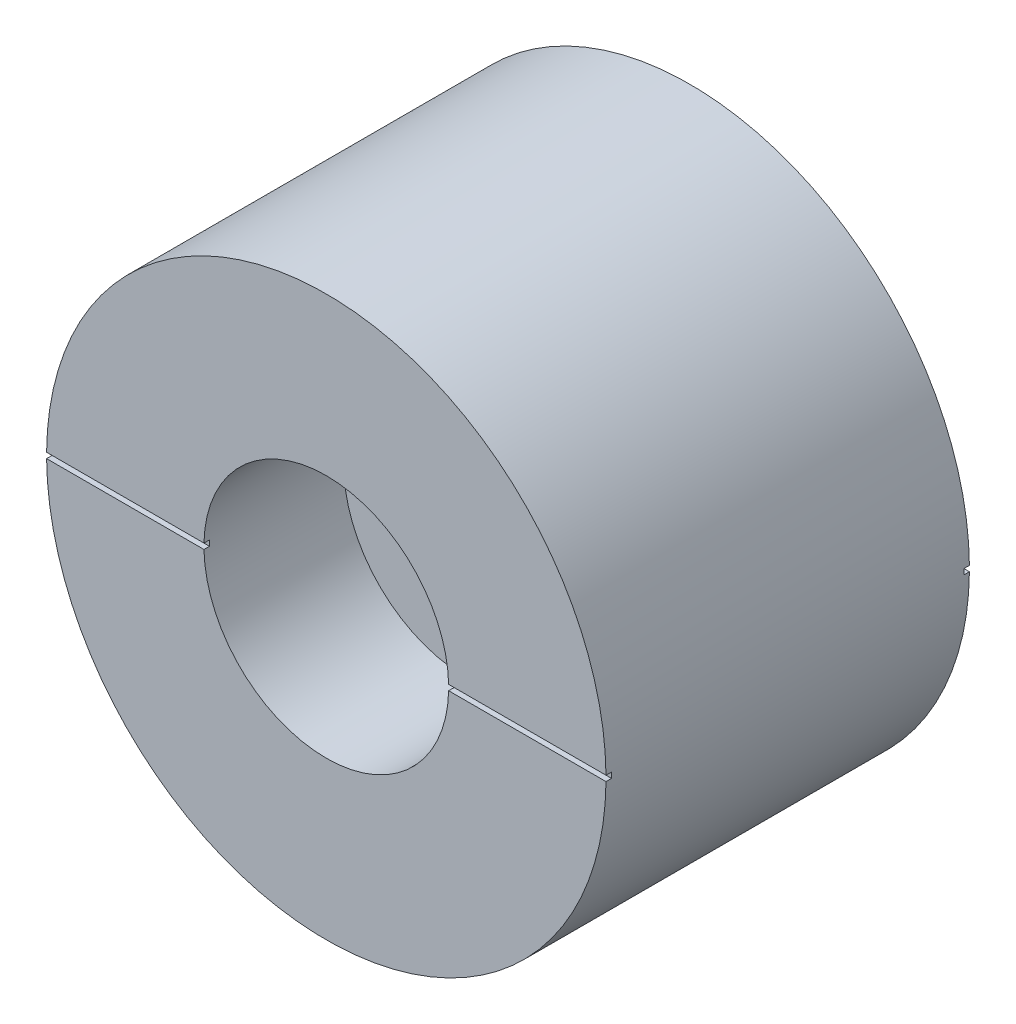
ISO-10303-21;
HEADER;
FILE_DESCRIPTION(('STEP AP214'),'2;1');
FILE_NAME('part.step','',(''),(''),'','','');
FILE_SCHEMA(('AUTOMOTIVE_DESIGN { 1 0 10303 214 1 1 1 1 }'));
ENDSEC;
DATA;
#1=APPLICATION_CONTEXT('core data for automotive mechanical design processes');
#2=APPLICATION_PROTOCOL_DEFINITION('international standard','automotive_design',2000,#1);
#3=PRODUCT_CONTEXT('',#1,'mechanical');
#4=PRODUCT('Part','Part','',(#3));
#5=PRODUCT_RELATED_PRODUCT_CATEGORY('part','',(#4));
#6=PRODUCT_DEFINITION_FORMATION('','',#4);
#7=PRODUCT_DEFINITION_CONTEXT('part definition',#1,'design');
#8=PRODUCT_DEFINITION('design','',#6,#7);
#9=PRODUCT_DEFINITION_SHAPE('','',#8);
#10=(LENGTH_UNIT() NAMED_UNIT(*) SI_UNIT(.MILLI.,.METRE.));
#11=(NAMED_UNIT(*) PLANE_ANGLE_UNIT() SI_UNIT($,.RADIAN.));
#12=(NAMED_UNIT(*) SI_UNIT($,.STERADIAN.) SOLID_ANGLE_UNIT());
#13=UNCERTAINTY_MEASURE_WITH_UNIT(LENGTH_MEASURE(1.E-05),#10,'distance_accuracy_value','');
#14=(GEOMETRIC_REPRESENTATION_CONTEXT(3) GLOBAL_UNCERTAINTY_ASSIGNED_CONTEXT((#13)) GLOBAL_UNIT_ASSIGNED_CONTEXT((#10,
#11,#12)) REPRESENTATION_CONTEXT('',''));
#15=CARTESIAN_POINT('',(0.,0.,0.));
#16=DIRECTION('',(0.,0.,1.));
#17=DIRECTION('',(1.,0.,0.));
#18=AXIS2_PLACEMENT_3D('',#15,#16,#17);
#19=CARTESIAN_POINT('',(0.,0.,0.));
#20=DIRECTION('',(0.,0.,1.));
#21=DIRECTION('',(1.,0.,0.));
#22=AXIS2_PLACEMENT_3D('',#19,#20,#21);
#23=PLANE('',#22);
#24=CARTESIAN_POINT('',(0.,0.,0.));
#25=DIRECTION('',(0.,0.,1.));
#26=DIRECTION('',(1.,0.,0.));
#27=AXIS2_PLACEMENT_3D('',#24,#25,#26);
#28=CIRCLE('',#27,12.7);
#29=CARTESIAN_POINT('',(12.6993848276206,0.125,0.));
#30=VERTEX_POINT('',#29);
#31=CARTESIAN_POINT('',(-12.6993848276206,0.125,0.));
#32=VERTEX_POINT('',#31);
#33=EDGE_CURVE('E525',#30,#32,#28,.T.);
#34=ORIENTED_EDGE('',*,*,#33,.F.);
#35=DIRECTION('',(1.,0.,0.));
#36=VECTOR('',#35,1.);
#37=CARTESIAN_POINT('',(13.4907838938573,0.125,0.));
#38=LINE('',#37,#36);
#39=CARTESIAN_POINT('',(3.2615055127962,0.125,0.));
#40=VERTEX_POINT('',#39);
#41=EDGE_CURVE('E519',#40,#30,#38,.T.);
#42=ORIENTED_EDGE('',*,*,#41,.F.);
#43=CARTESIAN_POINT('',(0.,0.,0.));
#44=DIRECTION('',(0.,0.,1.));
#45=DIRECTION('',(1.,0.,0.));
#46=AXIS2_PLACEMENT_3D('',#43,#44,#45);
#47=CIRCLE('',#46,3.2639);
#48=CARTESIAN_POINT('',(-3.2615055127962,0.125,0.));
#49=VERTEX_POINT('',#48);
#50=EDGE_CURVE('E577',#40,#49,#47,.T.);
#51=ORIENTED_EDGE('',*,*,#50,.T.);
#52=EDGE_CURVE('E726',#32,#49,#38,.T.);
#53=ORIENTED_EDGE('',*,*,#52,.F.);
#54=EDGE_LOOP('',(#34,#42,#51,#53));
#55=FACE_BOUND('',#54,.T.);
#56=ADVANCED_FACE('F388',(#55),#23,.F.);
#57=CARTESIAN_POINT('',(0.,0.,16.5));
#58=DIRECTION('',(0.,0.,1.));
#59=DIRECTION('',(1.,0.,0.));
#60=AXIS2_PLACEMENT_3D('',#57,#58,#59);
#61=PLANE('',#60);
#62=DIRECTION('',(-1.,0.,0.));
#63=VECTOR('',#62,1.);
#64=CARTESIAN_POINT('',(-13.1779541224056,0.125,16.5));
#65=LINE('',#64,#63);
#66=CARTESIAN_POINT('',(12.6993848276206,0.125,16.5));
#67=VERTEX_POINT('',#66);
#68=CARTESIAN_POINT('',(5.55484374780245,0.125,16.5));
#69=VERTEX_POINT('',#68);
#70=EDGE_CURVE('E617',#67,#69,#65,.T.);
#71=ORIENTED_EDGE('',*,*,#70,.F.);
#72=CARTESIAN_POINT('',(0.,0.,16.5));
#73=DIRECTION('',(0.,0.,1.));
#74=DIRECTION('',(1.,0.,0.));
#75=AXIS2_PLACEMENT_3D('',#72,#73,#74);
#76=CIRCLE('',#75,12.7);
#77=CARTESIAN_POINT('',(-12.6993848276206,0.125,16.5));
#78=VERTEX_POINT('',#77);
#79=EDGE_CURVE('E535',#67,#78,#76,.T.);
#80=ORIENTED_EDGE('',*,*,#79,.T.);
#81=CARTESIAN_POINT('',(-5.55484374780245,0.125,16.5));
#82=VERTEX_POINT('',#81);
#83=EDGE_CURVE('E611',#82,#78,#65,.T.);
#84=ORIENTED_EDGE('',*,*,#83,.F.);
#85=CARTESIAN_POINT('',(0.,0.,16.5));
#86=DIRECTION('',(0.,0.,1.));
#87=DIRECTION('',(1.,0.,0.));
#88=AXIS2_PLACEMENT_3D('',#85,#86,#87);
#89=CIRCLE('',#88,5.55625);
#90=EDGE_CURVE('E526',#69,#82,#89,.T.);
#91=ORIENTED_EDGE('',*,*,#90,.F.);
#92=EDGE_LOOP('',(#71,#80,#84,#91));
#93=FACE_BOUND('',#92,.T.);
#94=ADVANCED_FACE('F646',(#93),#61,.T.);
#95=CARTESIAN_POINT('',(0.,0.,16.5));
#96=DIRECTION('',(0.,0.,-1.));
#97=DIRECTION('',(-1.,0.,0.));
#98=AXIS2_PLACEMENT_3D('',#95,#96,#97);
#99=CYLINDRICAL_SURFACE('',#98,12.7);
#100=CARTESIAN_POINT('',(0.,0.,0.25));
#101=DIRECTION('',(0.,0.,-1.));
#102=DIRECTION('',(-1.,0.,0.));
#103=AXIS2_PLACEMENT_3D('',#100,#101,#102);
#104=CIRCLE('',#103,12.7);
#105=CARTESIAN_POINT('',(12.6993848276206,0.125,0.25));
#106=VERTEX_POINT('',#105);
#107=CARTESIAN_POINT('',(12.6993848276206,-0.125,0.25));
#108=VERTEX_POINT('',#107);
#109=EDGE_CURVE('E509',#106,#108,#104,.T.);
#110=ORIENTED_EDGE('',*,*,#109,.F.);
#111=DIRECTION('',(0.,0.,-1.));
#112=VECTOR('',#111,1.);
#113=CARTESIAN_POINT('',(12.6993848276206,0.125,16.5));
#114=LINE('',#113,#112);
#115=EDGE_CURVE('E571',#106,#30,#114,.T.);
#116=ORIENTED_EDGE('',*,*,#115,.T.);
#117=ORIENTED_EDGE('',*,*,#33,.T.);
#118=DIRECTION('',(0.,0.,-1.));
#119=VECTOR('',#118,1.);
#120=CARTESIAN_POINT('',(-12.6993848276206,0.125,16.5));
#121=LINE('',#120,#119);
#122=CARTESIAN_POINT('',(-12.6993848276206,0.125,0.25));
#123=VERTEX_POINT('',#122);
#124=EDGE_CURVE('E612',#32,#123,#121,.F.);
#125=ORIENTED_EDGE('',*,*,#124,.T.);
#126=CARTESIAN_POINT('',(-12.6993848276206,-0.125,0.25));
#127=VERTEX_POINT('',#126);
#128=EDGE_CURVE('E733',#127,#123,#104,.T.);
#129=ORIENTED_EDGE('',*,*,#128,.F.);
#130=DIRECTION('',(0.,0.,-1.));
#131=VECTOR('',#130,1.);
#132=CARTESIAN_POINT('',(-12.6993848276206,-0.125,16.5));
#133=LINE('',#132,#131);
#134=CARTESIAN_POINT('',(-12.6993848276206,-0.125,0.));
#135=VERTEX_POINT('',#134);
#136=EDGE_CURVE('E508',#127,#135,#133,.T.);
#137=ORIENTED_EDGE('',*,*,#136,.T.);
#138=CARTESIAN_POINT('',(12.6993848276206,-0.125,0.));
#139=VERTEX_POINT('',#138);
#140=EDGE_CURVE('E516',#135,#139,#28,.T.);
#141=ORIENTED_EDGE('',*,*,#140,.T.);
#142=DIRECTION('',(0.,0.,-1.));
#143=VECTOR('',#142,1.);
#144=CARTESIAN_POINT('',(12.6993848276206,-0.125,16.5));
#145=LINE('',#144,#143);
#146=EDGE_CURVE('E500',#139,#108,#145,.F.);
#147=ORIENTED_EDGE('',*,*,#146,.T.);
#148=EDGE_LOOP('',(#110,#116,#117,#125,#129,#137,#141,#147));
#149=FACE_BOUND('',#148,.T.);
#150=CARTESIAN_POINT('',(0.,0.,16.25));
#151=DIRECTION('',(0.,0.,1.));
#152=DIRECTION('',(1.,0.,0.));
#153=AXIS2_PLACEMENT_3D('',#150,#151,#152);
#154=CIRCLE('',#153,12.7);
#155=CARTESIAN_POINT('',(-12.6993848276206,0.125,16.25));
#156=VERTEX_POINT('',#155);
#157=CARTESIAN_POINT('',(-12.6993848276206,-0.125,16.25));
#158=VERTEX_POINT('',#157);
#159=EDGE_CURVE('E628',#156,#158,#154,.T.);
#160=ORIENTED_EDGE('',*,*,#159,.F.);
#161=DIRECTION('',(0.,0.,-1.));
#162=VECTOR('',#161,1.);
#163=CARTESIAN_POINT('',(-12.6993848276206,0.125,16.5));
#164=LINE('',#163,#162);
#165=EDGE_CURVE('E633',#156,#78,#164,.F.);
#166=ORIENTED_EDGE('',*,*,#165,.T.);
#167=ORIENTED_EDGE('',*,*,#79,.F.);
#168=DIRECTION('',(0.,0.,-1.));
#169=VECTOR('',#168,1.);
#170=CARTESIAN_POINT('',(12.6993848276206,0.125,16.5));
#171=LINE('',#170,#169);
#172=CARTESIAN_POINT('',(12.6993848276206,0.125,16.25));
#173=VERTEX_POINT('',#172);
#174=EDGE_CURVE('E586',#67,#173,#171,.T.);
#175=ORIENTED_EDGE('',*,*,#174,.T.);
#176=CARTESIAN_POINT('',(12.6993848276206,-0.125,16.25));
#177=VERTEX_POINT('',#176);
#178=EDGE_CURVE('E626',#177,#173,#154,.T.);
#179=ORIENTED_EDGE('',*,*,#178,.F.);
#180=DIRECTION('',(0.,0.,-1.));
#181=VECTOR('',#180,1.);
#182=CARTESIAN_POINT('',(12.6993848276206,-0.125,16.5));
#183=LINE('',#182,#181);
#184=CARTESIAN_POINT('',(12.6993848276206,-0.125,16.5));
#185=VERTEX_POINT('',#184);
#186=EDGE_CURVE('E629',#177,#185,#183,.F.);
#187=ORIENTED_EDGE('',*,*,#186,.T.);
#188=CARTESIAN_POINT('',(-12.6993848276206,-0.125,16.5));
#189=VERTEX_POINT('',#188);
#190=EDGE_CURVE('E529',#189,#185,#76,.T.);
#191=ORIENTED_EDGE('',*,*,#190,.F.);
#192=DIRECTION('',(0.,0.,-1.));
#193=VECTOR('',#192,1.);
#194=CARTESIAN_POINT('',(-12.6993848276206,-0.125,16.5));
#195=LINE('',#194,#193);
#196=EDGE_CURVE('E631',#189,#158,#195,.T.);
#197=ORIENTED_EDGE('',*,*,#196,.T.);
#198=EDGE_LOOP('',(#160,#166,#167,#175,#179,#187,#191,#197));
#199=FACE_BOUND('',#198,.T.);
#200=ADVANCED_FACE('F390',(#149,#199),#99,.T.);
#201=DIRECTION('',(1.,0.,0.));
#202=VECTOR('',#201,1.);
#203=CARTESIAN_POINT('',(-13.1779541224056,-0.125,16.5));
#204=LINE('',#203,#202);
#205=CARTESIAN_POINT('',(-5.55484374780245,-0.125,16.5));
#206=VERTEX_POINT('',#205);
#207=EDGE_CURVE('E605',#189,#206,#204,.T.);
#208=ORIENTED_EDGE('',*,*,#207,.F.);
#209=ORIENTED_EDGE('',*,*,#190,.T.);
#210=CARTESIAN_POINT('',(5.55484374780245,-0.125,16.5));
#211=VERTEX_POINT('',#210);
#212=EDGE_CURVE('E607',#211,#185,#204,.T.);
#213=ORIENTED_EDGE('',*,*,#212,.F.);
#214=EDGE_CURVE('E531',#206,#211,#89,.T.);
#215=ORIENTED_EDGE('',*,*,#214,.F.);
#216=EDGE_LOOP('',(#208,#209,#213,#215));
#217=FACE_BOUND('',#216,.T.);
#218=ADVANCED_FACE('F603',(#217),#61,.T.);
#219=ORIENTED_EDGE('',*,*,#140,.F.);
#220=DIRECTION('',(-1.,0.,0.));
#221=VECTOR('',#220,1.);
#222=CARTESIAN_POINT('',(13.4907838938573,-0.125,0.));
#223=LINE('',#222,#221);
#224=CARTESIAN_POINT('',(-3.2615055127962,-0.125,0.));
#225=VERTEX_POINT('',#224);
#226=EDGE_CURVE('E520',#225,#135,#223,.T.);
#227=ORIENTED_EDGE('',*,*,#226,.F.);
#228=CARTESIAN_POINT('',(3.2615055127962,-0.125,0.));
#229=VERTEX_POINT('',#228);
#230=EDGE_CURVE('E518',#225,#229,#47,.T.);
#231=ORIENTED_EDGE('',*,*,#230,.T.);
#232=EDGE_CURVE('E503',#139,#229,#223,.T.);
#233=ORIENTED_EDGE('',*,*,#232,.F.);
#234=EDGE_LOOP('',(#219,#227,#231,#233));
#235=FACE_BOUND('',#234,.T.);
#236=ADVANCED_FACE('F514',(#235),#23,.F.);
#237=CARTESIAN_POINT('',(0.,0.,16.5));
#238=DIRECTION('',(0.,0.,1.));
#239=DIRECTION('',(1.,0.,0.));
#240=AXIS2_PLACEMENT_3D('',#237,#238,#239);
#241=CYLINDRICAL_SURFACE('',#240,5.55625);
#242=ORIENTED_EDGE('',*,*,#90,.T.);
#243=DIRECTION('',(0.,0.,1.));
#244=VECTOR('',#243,1.);
#245=CARTESIAN_POINT('',(-5.55484374780245,0.125,16.5));
#246=LINE('',#245,#244);
#247=CARTESIAN_POINT('',(-5.55484374780245,0.125,16.25));
#248=VERTEX_POINT('',#247);
#249=EDGE_CURVE('E550',#82,#248,#246,.F.);
#250=ORIENTED_EDGE('',*,*,#249,.T.);
#251=CARTESIAN_POINT('',(0.,0.,16.25));
#252=DIRECTION('',(0.,0.,1.));
#253=DIRECTION('',(1.,0.,0.));
#254=AXIS2_PLACEMENT_3D('',#251,#252,#253);
#255=CIRCLE('',#254,5.55625);
#256=CARTESIAN_POINT('',(-5.55484374780245,-0.125,16.25));
#257=VERTEX_POINT('',#256);
#258=EDGE_CURVE('E541',#257,#248,#255,.F.);
#259=ORIENTED_EDGE('',*,*,#258,.F.);
#260=DIRECTION('',(0.,0.,1.));
#261=VECTOR('',#260,1.);
#262=CARTESIAN_POINT('',(-5.55484374780245,-0.125,16.5));
#263=LINE('',#262,#261);
#264=EDGE_CURVE('E547',#257,#206,#263,.T.);
#265=ORIENTED_EDGE('',*,*,#264,.T.);
#266=ORIENTED_EDGE('',*,*,#214,.T.);
#267=DIRECTION('',(0.,0.,1.));
#268=VECTOR('',#267,1.);
#269=CARTESIAN_POINT('',(5.55484374780245,-0.125,16.5));
#270=LINE('',#269,#268);
#271=CARTESIAN_POINT('',(5.55484374780245,-0.125,16.25));
#272=VERTEX_POINT('',#271);
#273=EDGE_CURVE('E540',#211,#272,#270,.F.);
#274=ORIENTED_EDGE('',*,*,#273,.T.);
#275=CARTESIAN_POINT('',(5.55484374780245,0.125,16.25));
#276=VERTEX_POINT('',#275);
#277=EDGE_CURVE('E538',#276,#272,#255,.F.);
#278=ORIENTED_EDGE('',*,*,#277,.F.);
#279=DIRECTION('',(0.,0.,1.));
#280=VECTOR('',#279,1.);
#281=CARTESIAN_POINT('',(5.55484374780245,0.125,16.5));
#282=LINE('',#281,#280);
#283=EDGE_CURVE('E544',#276,#69,#282,.T.);
#284=ORIENTED_EDGE('',*,*,#283,.T.);
#285=EDGE_LOOP('',(#242,#250,#259,#265,#266,#274,#278,#284));
#286=FACE_BOUND('',#285,.T.);
#287=CARTESIAN_POINT('',(0.,0.,10.15));
#288=DIRECTION('',(0.,0.,1.));
#289=DIRECTION('',(1.,0.,0.));
#290=AXIS2_PLACEMENT_3D('',#287,#288,#289);
#291=CIRCLE('',#290,5.55625);
#292=CARTESIAN_POINT('',(5.55625,0.,10.15));
#293=VERTEX_POINT('',#292);
#294=EDGE_CURVE('E584',#293,#293,#291,.T.);
#295=ORIENTED_EDGE('',*,*,#294,.F.);
#296=EDGE_LOOP('',(#295));
#297=FACE_BOUND('',#296,.T.);
#298=ADVANCED_FACE('F595',(#286,#297),#241,.F.);
#299=CARTESIAN_POINT('',(3.2639,0.,10.15));
#300=DIRECTION('',(0.,0.,-1.));
#301=DIRECTION('',(-1.,0.,0.));
#302=AXIS2_PLACEMENT_3D('',#299,#300,#301);
#303=PLANE('',#302);
#304=CARTESIAN_POINT('',(0.,0.,10.15));
#305=DIRECTION('',(0.,0.,1.));
#306=DIRECTION('',(1.,0.,0.));
#307=AXIS2_PLACEMENT_3D('',#304,#305,#306);
#308=CIRCLE('',#307,3.2639);
#309=CARTESIAN_POINT('',(3.2639,0.,10.15));
#310=VERTEX_POINT('',#309);
#311=EDGE_CURVE('E581',#310,#310,#308,.T.);
#312=ORIENTED_EDGE('',*,*,#311,.F.);
#313=EDGE_LOOP('',(#312));
#314=FACE_BOUND('',#313,.T.);
#315=ORIENTED_EDGE('',*,*,#294,.T.);
#316=EDGE_LOOP('',(#315));
#317=FACE_BOUND('',#316,.T.);
#318=ADVANCED_FACE('F682',(#314,#317),#303,.F.);
#319=CARTESIAN_POINT('',(0.,0.,16.5));
#320=DIRECTION('',(0.,0.,1.));
#321=DIRECTION('',(1.,0.,0.));
#322=AXIS2_PLACEMENT_3D('',#319,#320,#321);
#323=CYLINDRICAL_SURFACE('',#322,3.2639);
#324=ORIENTED_EDGE('',*,*,#50,.F.);
#325=DIRECTION('',(0.,0.,1.));
#326=VECTOR('',#325,1.);
#327=CARTESIAN_POINT('',(3.2615055127962,0.125,16.5));
#328=LINE('',#327,#326);
#329=CARTESIAN_POINT('',(3.2615055127962,0.125,0.25));
#330=VERTEX_POINT('',#329);
#331=EDGE_CURVE('E12',#40,#330,#328,.T.);
#332=ORIENTED_EDGE('',*,*,#331,.T.);
#333=CARTESIAN_POINT('',(0.,0.,0.25));
#334=DIRECTION('',(0.,0.,-1.));
#335=DIRECTION('',(-1.,0.,0.));
#336=AXIS2_PLACEMENT_3D('',#333,#334,#335);
#337=CIRCLE('',#336,3.2639);
#338=CARTESIAN_POINT('',(3.2615055127962,-0.125,0.25));
#339=VERTEX_POINT('',#338);
#340=EDGE_CURVE('E556',#339,#330,#337,.F.);
#341=ORIENTED_EDGE('',*,*,#340,.F.);
#342=DIRECTION('',(0.,0.,1.));
#343=VECTOR('',#342,1.);
#344=CARTESIAN_POINT('',(3.2615055127962,-0.125,16.5));
#345=LINE('',#344,#343);
#346=EDGE_CURVE('E396',#339,#229,#345,.F.);
#347=ORIENTED_EDGE('',*,*,#346,.T.);
#348=ORIENTED_EDGE('',*,*,#230,.F.);
#349=DIRECTION('',(0.,0.,1.));
#350=VECTOR('',#349,1.);
#351=CARTESIAN_POINT('',(-3.2615055127962,-0.125,16.5));
#352=LINE('',#351,#350);
#353=CARTESIAN_POINT('',(-3.2615055127962,-0.125,0.25));
#354=VERTEX_POINT('',#353);
#355=EDGE_CURVE('E555',#225,#354,#352,.T.);
#356=ORIENTED_EDGE('',*,*,#355,.T.);
#357=CARTESIAN_POINT('',(-3.2615055127962,0.125,0.25));
#358=VERTEX_POINT('',#357);
#359=EDGE_CURVE('E553',#358,#354,#337,.F.);
#360=ORIENTED_EDGE('',*,*,#359,.F.);
#361=DIRECTION('',(0.,0.,1.));
#362=VECTOR('',#361,1.);
#363=CARTESIAN_POINT('',(-3.2615055127962,0.125,16.5));
#364=LINE('',#363,#362);
#365=EDGE_CURVE('E559',#358,#49,#364,.F.);
#366=ORIENTED_EDGE('',*,*,#365,.T.);
#367=EDGE_LOOP('',(#324,#332,#341,#347,#348,#356,#360,#366));
#368=FACE_BOUND('',#367,.T.);
#369=ORIENTED_EDGE('',*,*,#311,.T.);
#370=EDGE_LOOP('',(#369));
#371=FACE_BOUND('',#370,.T.);
#372=ADVANCED_FACE('F574',(#368,#371),#323,.F.);
#373=CARTESIAN_POINT('',(-13.1779541224056,-0.125,16.25));
#374=DIRECTION('',(0.,0.,1.));
#375=DIRECTION('',(1.,0.,0.));
#376=AXIS2_PLACEMENT_3D('',#373,#374,#375);
#377=PLANE('',#376);
#378=ORIENTED_EDGE('',*,*,#178,.T.);
#379=DIRECTION('',(-1.,0.,0.));
#380=VECTOR('',#379,1.);
#381=CARTESIAN_POINT('',(-13.1779541224056,0.125,16.25));
#382=LINE('',#381,#380);
#383=EDGE_CURVE('E625',#173,#276,#382,.T.);
#384=ORIENTED_EDGE('',*,*,#383,.T.);
#385=ORIENTED_EDGE('',*,*,#277,.T.);
#386=DIRECTION('',(1.,0.,0.));
#387=VECTOR('',#386,1.);
#388=CARTESIAN_POINT('',(-13.1779541224056,-0.125,16.25));
#389=LINE('',#388,#387);
#390=EDGE_CURVE('E618',#272,#177,#389,.T.);
#391=ORIENTED_EDGE('',*,*,#390,.T.);
#392=EDGE_LOOP('',(#378,#384,#385,#391));
#393=FACE_BOUND('',#392,.T.);
#394=ADVANCED_FACE('F650',(#393),#377,.T.);
#395=CARTESIAN_POINT('',(-13.1779541224056,-0.125,16.25));
#396=DIRECTION('',(0.,-1.,0.));
#397=DIRECTION('',(0.,0.,-1.));
#398=AXIS2_PLACEMENT_3D('',#395,#396,#397);
#399=PLANE('',#398);
#400=ORIENTED_EDGE('',*,*,#390,.F.);
#401=ORIENTED_EDGE('',*,*,#273,.F.);
#402=ORIENTED_EDGE('',*,*,#212,.T.);
#403=ORIENTED_EDGE('',*,*,#186,.F.);
#404=EDGE_LOOP('',(#400,#401,#402,#403));
#405=FACE_BOUND('',#404,.T.);
#406=ADVANCED_FACE('F651',(#405),#399,.F.);
#407=CARTESIAN_POINT('',(-13.1779541224056,0.125,16.25));
#408=DIRECTION('',(0.,1.,0.));
#409=DIRECTION('',(0.,0.,1.));
#410=AXIS2_PLACEMENT_3D('',#407,#408,#409);
#411=PLANE('',#410);
#412=ORIENTED_EDGE('',*,*,#70,.T.);
#413=ORIENTED_EDGE('',*,*,#283,.F.);
#414=ORIENTED_EDGE('',*,*,#383,.F.);
#415=ORIENTED_EDGE('',*,*,#174,.F.);
#416=EDGE_LOOP('',(#412,#413,#414,#415));
#417=FACE_BOUND('',#416,.T.);
#418=ADVANCED_FACE('F642',(#417),#411,.F.);
#419=EDGE_CURVE('E622',#248,#156,#382,.T.);
#420=ORIENTED_EDGE('',*,*,#419,.F.);
#421=ORIENTED_EDGE('',*,*,#249,.F.);
#422=ORIENTED_EDGE('',*,*,#83,.T.);
#423=ORIENTED_EDGE('',*,*,#165,.F.);
#424=EDGE_LOOP('',(#420,#421,#422,#423));
#425=FACE_BOUND('',#424,.T.);
#426=ADVANCED_FACE('F659',(#425),#411,.F.);
#427=ORIENTED_EDGE('',*,*,#207,.T.);
#428=ORIENTED_EDGE('',*,*,#264,.F.);
#429=EDGE_CURVE('E621',#158,#257,#389,.T.);
#430=ORIENTED_EDGE('',*,*,#429,.F.);
#431=ORIENTED_EDGE('',*,*,#196,.F.);
#432=EDGE_LOOP('',(#427,#428,#430,#431));
#433=FACE_BOUND('',#432,.T.);
#434=ADVANCED_FACE('F654',(#433),#399,.F.);
#435=ORIENTED_EDGE('',*,*,#159,.T.);
#436=ORIENTED_EDGE('',*,*,#429,.T.);
#437=ORIENTED_EDGE('',*,*,#258,.T.);
#438=ORIENTED_EDGE('',*,*,#419,.T.);
#439=EDGE_LOOP('',(#435,#436,#437,#438));
#440=FACE_BOUND('',#439,.T.);
#441=ADVANCED_FACE('F656',(#440),#377,.T.);
#442=CARTESIAN_POINT('',(13.4907838938573,-0.125,0.25));
#443=DIRECTION('',(0.,0.,-1.));
#444=DIRECTION('',(-1.,0.,0.));
#445=AXIS2_PLACEMENT_3D('',#442,#443,#444);
#446=PLANE('',#445);
#447=ORIENTED_EDGE('',*,*,#128,.T.);
#448=DIRECTION('',(1.,0.,0.));
#449=VECTOR('',#448,1.);
#450=CARTESIAN_POINT('',(13.4907838938573,0.125,0.25));
#451=LINE('',#450,#449);
#452=EDGE_CURVE('E411',#123,#358,#451,.T.);
#453=ORIENTED_EDGE('',*,*,#452,.T.);
#454=ORIENTED_EDGE('',*,*,#359,.T.);
#455=DIRECTION('',(-1.,0.,0.));
#456=VECTOR('',#455,1.);
#457=CARTESIAN_POINT('',(13.4907838938573,-0.125,0.25));
#458=LINE('',#457,#456);
#459=EDGE_CURVE('E728',#354,#127,#458,.T.);
#460=ORIENTED_EDGE('',*,*,#459,.T.);
#461=EDGE_LOOP('',(#447,#453,#454,#460));
#462=FACE_BOUND('',#461,.T.);
#463=ADVANCED_FACE('F702',(#462),#446,.T.);
#464=CARTESIAN_POINT('',(13.4907838938573,-0.125,0.25));
#465=DIRECTION('',(0.,-1.,0.));
#466=DIRECTION('',(0.,0.,-1.));
#467=AXIS2_PLACEMENT_3D('',#464,#465,#466);
#468=PLANE('',#467);
#469=ORIENTED_EDGE('',*,*,#459,.F.);
#470=ORIENTED_EDGE('',*,*,#355,.F.);
#471=ORIENTED_EDGE('',*,*,#226,.T.);
#472=ORIENTED_EDGE('',*,*,#136,.F.);
#473=EDGE_LOOP('',(#469,#470,#471,#472));
#474=FACE_BOUND('',#473,.T.);
#475=ADVANCED_FACE('F705',(#474),#468,.F.);
#476=CARTESIAN_POINT('',(13.4907838938573,0.125,0.25));
#477=DIRECTION('',(0.,1.,0.));
#478=DIRECTION('',(0.,0.,1.));
#479=AXIS2_PLACEMENT_3D('',#476,#477,#478);
#480=PLANE('',#479);
#481=ORIENTED_EDGE('',*,*,#52,.T.);
#482=ORIENTED_EDGE('',*,*,#365,.F.);
#483=ORIENTED_EDGE('',*,*,#452,.F.);
#484=ORIENTED_EDGE('',*,*,#124,.F.);
#485=EDGE_LOOP('',(#481,#482,#483,#484));
#486=FACE_BOUND('',#485,.T.);
#487=ADVANCED_FACE('F710',(#486),#480,.F.);
#488=EDGE_CURVE('E566',#330,#106,#451,.T.);
#489=ORIENTED_EDGE('',*,*,#488,.F.);
#490=ORIENTED_EDGE('',*,*,#331,.F.);
#491=ORIENTED_EDGE('',*,*,#41,.T.);
#492=ORIENTED_EDGE('',*,*,#115,.F.);
#493=EDGE_LOOP('',(#489,#490,#491,#492));
#494=FACE_BOUND('',#493,.T.);
#495=ADVANCED_FACE('F568',(#494),#480,.F.);
#496=ORIENTED_EDGE('',*,*,#232,.T.);
#497=ORIENTED_EDGE('',*,*,#346,.F.);
#498=EDGE_CURVE('E403',#108,#339,#458,.T.);
#499=ORIENTED_EDGE('',*,*,#498,.F.);
#500=ORIENTED_EDGE('',*,*,#146,.F.);
#501=EDGE_LOOP('',(#496,#497,#499,#500));
#502=FACE_BOUND('',#501,.T.);
#503=ADVANCED_FACE('F502',(#502),#468,.F.);
#504=ORIENTED_EDGE('',*,*,#109,.T.);
#505=ORIENTED_EDGE('',*,*,#498,.T.);
#506=ORIENTED_EDGE('',*,*,#340,.T.);
#507=ORIENTED_EDGE('',*,*,#488,.T.);
#508=EDGE_LOOP('',(#504,#505,#506,#507));
#509=FACE_BOUND('',#508,.T.);
#510=ADVANCED_FACE('F565',(#509),#446,.T.);
#511=CLOSED_SHELL('',(#56,#94,#200,#218,#236,#298,#318,#372,#394,#406,#418,#426,#434,#441,#463,
#475,#487,#495,#503,#510));
#512=MANIFOLD_SOLID_BREP('B2',#511);
#513=ADVANCED_BREP_SHAPE_REPRESENTATION('',(#18,#512),#14);
#514=SHAPE_DEFINITION_REPRESENTATION(#9,#513);
ENDSEC;
END-ISO-10303-21;
